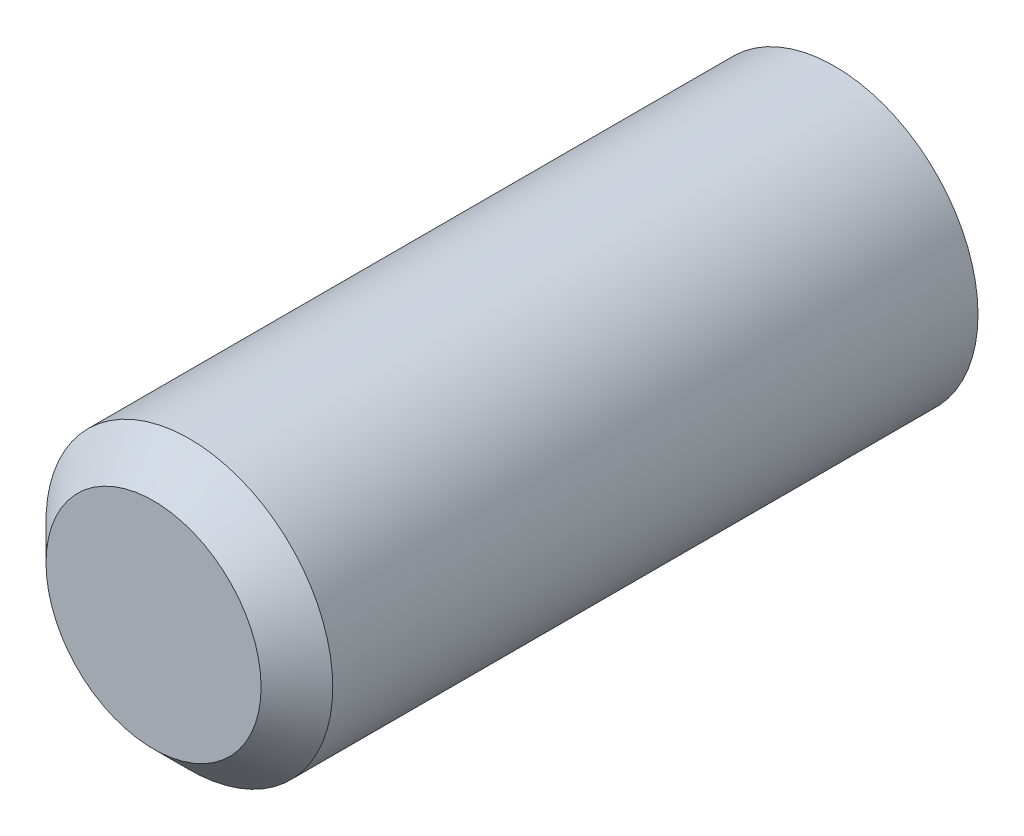
ISO-10303-21;
HEADER;
FILE_DESCRIPTION(('STEP AP214'),'2;1');
FILE_NAME('part.step','',(''),(''),'','','');
FILE_SCHEMA(('AUTOMOTIVE_DESIGN { 1 0 10303 214 1 1 1 1 }'));
ENDSEC;
DATA;
#1=APPLICATION_CONTEXT('core data for automotive mechanical design processes');
#2=APPLICATION_PROTOCOL_DEFINITION('international standard','automotive_design',2000,#1);
#3=PRODUCT_CONTEXT('',#1,'mechanical');
#4=PRODUCT('Part','Part','',(#3));
#5=PRODUCT_RELATED_PRODUCT_CATEGORY('part','',(#4));
#6=PRODUCT_DEFINITION_FORMATION('','',#4);
#7=PRODUCT_DEFINITION_CONTEXT('part definition',#1,'design');
#8=PRODUCT_DEFINITION('design','',#6,#7);
#9=PRODUCT_DEFINITION_SHAPE('','',#8);
#10=(LENGTH_UNIT() NAMED_UNIT(*) SI_UNIT(.MILLI.,.METRE.));
#11=(NAMED_UNIT(*) PLANE_ANGLE_UNIT() SI_UNIT($,.RADIAN.));
#12=(NAMED_UNIT(*) SI_UNIT($,.STERADIAN.) SOLID_ANGLE_UNIT());
#13=UNCERTAINTY_MEASURE_WITH_UNIT(LENGTH_MEASURE(1.E-05),#10,'distance_accuracy_value','');
#14=(GEOMETRIC_REPRESENTATION_CONTEXT(3) GLOBAL_UNCERTAINTY_ASSIGNED_CONTEXT((#13)) GLOBAL_UNIT_ASSIGNED_CONTEXT((#10,
#11,#12)) REPRESENTATION_CONTEXT('',''));
#15=CARTESIAN_POINT('',(0.,0.,0.));
#16=DIRECTION('',(0.,0.,1.));
#17=DIRECTION('',(1.,0.,0.));
#18=AXIS2_PLACEMENT_3D('',#15,#16,#17);
#19=CARTESIAN_POINT('',(0.,0.,47.5));
#20=DIRECTION('',(0.,0.,-1.));
#21=DIRECTION('',(-1.,0.,0.));
#22=AXIS2_PLACEMENT_3D('',#19,#20,#21);
#23=CYLINDRICAL_SURFACE('',#22,10.);
#24=CARTESIAN_POINT('',(0.,0.,45.));
#25=DIRECTION('',(0.,0.,1.));
#26=DIRECTION('',(1.,0.,0.));
#27=AXIS2_PLACEMENT_3D('',#24,#25,#26);
#28=CIRCLE('',#27,10.);
#29=CARTESIAN_POINT('',(10.,0.,45.));
#30=VERTEX_POINT('',#29);
#31=EDGE_CURVE('E10',#30,#30,#28,.F.);
#32=ORIENTED_EDGE('',*,*,#31,.T.);
#33=EDGE_LOOP('',(#32));
#34=FACE_BOUND('',#33,.T.);
#35=CARTESIAN_POINT('',(0.,0.,0.));
#36=DIRECTION('',(0.,0.,1.));
#37=DIRECTION('',(1.,0.,0.));
#38=AXIS2_PLACEMENT_3D('',#35,#36,#37);
#39=CIRCLE('',#38,10.);
#40=CARTESIAN_POINT('',(10.,0.,0.));
#41=VERTEX_POINT('',#40);
#42=EDGE_CURVE('E45',#41,#41,#39,.T.);
#43=ORIENTED_EDGE('',*,*,#42,.T.);
#44=EDGE_LOOP('',(#43));
#45=FACE_BOUND('',#44,.T.);
#46=ADVANCED_FACE('F33',(#34,#45),#23,.T.);
#47=CARTESIAN_POINT('',(0.,0.,47.5));
#48=DIRECTION('',(0.,0.,1.));
#49=DIRECTION('',(1.,0.,0.));
#50=AXIS2_PLACEMENT_3D('',#47,#48,#49);
#51=PLANE('',#50);
#52=CARTESIAN_POINT('',(0.,0.,47.5));
#53=DIRECTION('',(0.,0.,1.));
#54=DIRECTION('',(1.,0.,0.));
#55=AXIS2_PLACEMENT_3D('',#52,#53,#54);
#56=CIRCLE('',#55,7.5);
#57=CARTESIAN_POINT('',(7.5,0.,47.5));
#58=VERTEX_POINT('',#57);
#59=EDGE_CURVE('E41',#58,#58,#56,.T.);
#60=ORIENTED_EDGE('',*,*,#59,.T.);
#61=EDGE_LOOP('',(#60));
#62=FACE_BOUND('',#61,.T.);
#63=ADVANCED_FACE('F55',(#62),#51,.T.);
#64=CARTESIAN_POINT('',(0.,0.,0.));
#65=DIRECTION('',(0.,0.,1.));
#66=DIRECTION('',(1.,0.,0.));
#67=AXIS2_PLACEMENT_3D('',#64,#65,#66);
#68=PLANE('',#67);
#69=ORIENTED_EDGE('',*,*,#42,.F.);
#70=EDGE_LOOP('',(#69));
#71=FACE_BOUND('',#70,.T.);
#72=ADVANCED_FACE('F53',(#71),#68,.F.);
#73=CARTESIAN_POINT('',(0.,0.,47.5));
#74=DIRECTION('',(0.,0.,-1.));
#75=DIRECTION('',(-1.,0.,0.));
#76=AXIS2_PLACEMENT_3D('',#73,#74,#75);
#77=CONICAL_SURFACE('',#76,7.5,0.785398163397447);
#78=ORIENTED_EDGE('',*,*,#31,.F.);
#79=EDGE_LOOP('',(#78));
#80=FACE_BOUND('',#79,.T.);
#81=ORIENTED_EDGE('',*,*,#59,.F.);
#82=EDGE_LOOP('',(#81));
#83=FACE_BOUND('',#82,.T.);
#84=ADVANCED_FACE('F36',(#80,#83),#77,.T.);
#85=CLOSED_SHELL('',(#46,#63,#72,#84));
#86=MANIFOLD_SOLID_BREP('B2',#85);
#87=ADVANCED_BREP_SHAPE_REPRESENTATION('',(#18,#86),#14);
#88=SHAPE_DEFINITION_REPRESENTATION(#9,#87);
ENDSEC;
END-ISO-10303-21;
